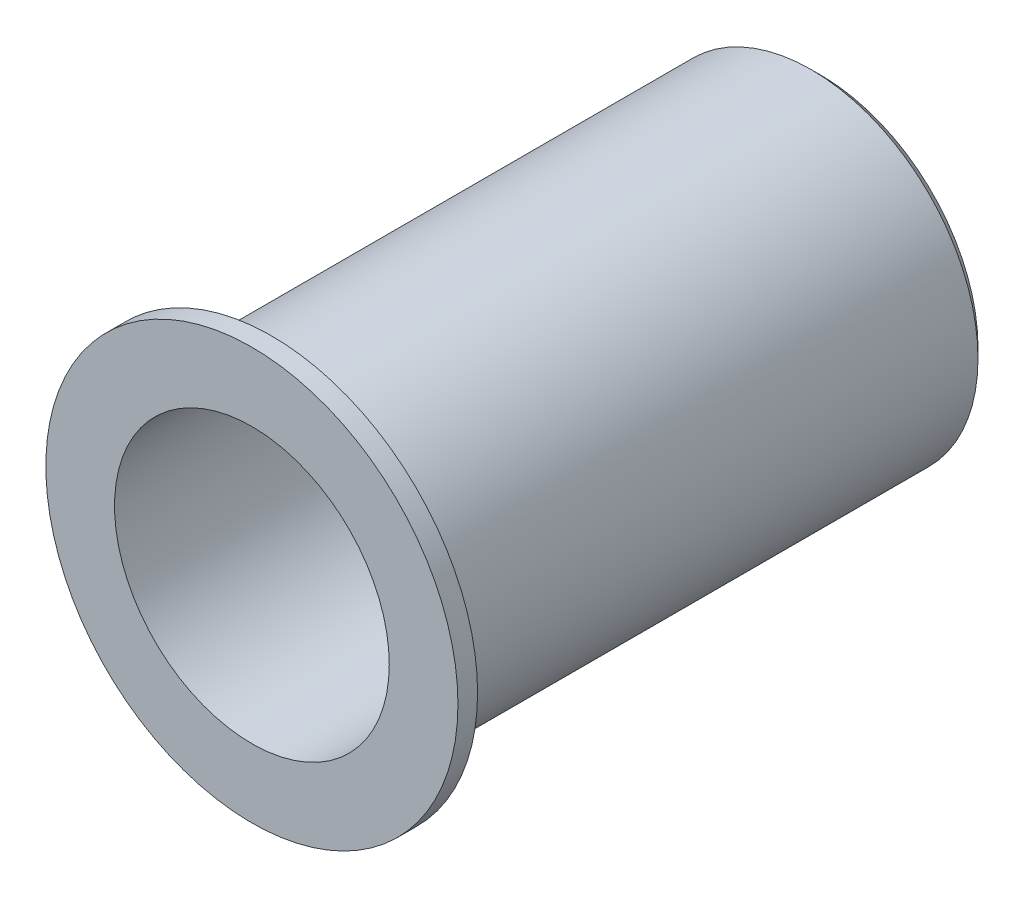
ISO-10303-21;
HEADER;
FILE_DESCRIPTION(('STEP AP214'),'2;1');
FILE_NAME('part.step','',(''),(''),'','','');
FILE_SCHEMA(('AUTOMOTIVE_DESIGN { 1 0 10303 214 1 1 1 1 }'));
ENDSEC;
DATA;
#1=APPLICATION_CONTEXT('core data for automotive mechanical design processes');
#2=APPLICATION_PROTOCOL_DEFINITION('international standard','automotive_design',2000,#1);
#3=PRODUCT_CONTEXT('',#1,'mechanical');
#4=PRODUCT('Part','Part','',(#3));
#5=PRODUCT_RELATED_PRODUCT_CATEGORY('part','',(#4));
#6=PRODUCT_DEFINITION_FORMATION('','',#4);
#7=PRODUCT_DEFINITION_CONTEXT('part definition',#1,'design');
#8=PRODUCT_DEFINITION('design','',#6,#7);
#9=PRODUCT_DEFINITION_SHAPE('','',#8);
#10=(LENGTH_UNIT() NAMED_UNIT(*) SI_UNIT(.MILLI.,.METRE.));
#11=(NAMED_UNIT(*) PLANE_ANGLE_UNIT() SI_UNIT($,.RADIAN.));
#12=(NAMED_UNIT(*) SI_UNIT($,.STERADIAN.) SOLID_ANGLE_UNIT());
#13=UNCERTAINTY_MEASURE_WITH_UNIT(LENGTH_MEASURE(1.E-05),#10,'distance_accuracy_value','');
#14=(GEOMETRIC_REPRESENTATION_CONTEXT(3) GLOBAL_UNCERTAINTY_ASSIGNED_CONTEXT((#13)) GLOBAL_UNIT_ASSIGNED_CONTEXT((#10,
#11,#12)) REPRESENTATION_CONTEXT('',''));
#15=CARTESIAN_POINT('',(0.,0.,0.));
#16=DIRECTION('',(0.,0.,1.));
#17=DIRECTION('',(1.,0.,0.));
#18=AXIS2_PLACEMENT_3D('',#15,#16,#17);
#19=CARTESIAN_POINT('',(0.,0.,28.));
#20=DIRECTION('',(0.,0.,-1.));
#21=DIRECTION('',(-1.,0.,0.));
#22=AXIS2_PLACEMENT_3D('',#19,#20,#21);
#23=CYLINDRICAL_SURFACE('',#22,8.5);
#24=CARTESIAN_POINT('',(0.,0.,0.500000000000007));
#25=DIRECTION('',(0.,0.,1.));
#26=DIRECTION('',(1.,0.,0.));
#27=AXIS2_PLACEMENT_3D('',#24,#25,#26);
#28=CIRCLE('',#27,8.5);
#29=CARTESIAN_POINT('',(8.5,0.,0.500000000000007));
#30=VERTEX_POINT('',#29);
#31=EDGE_CURVE('E51',#30,#30,#28,.T.);
#32=ORIENTED_EDGE('',*,*,#31,.T.);
#33=EDGE_LOOP('',(#32));
#34=FACE_BOUND('',#33,.T.);
#35=CARTESIAN_POINT('',(0.,0.,28.));
#36=DIRECTION('',(0.,0.,1.));
#37=DIRECTION('',(1.,0.,0.));
#38=AXIS2_PLACEMENT_3D('',#35,#36,#37);
#39=CIRCLE('',#38,8.5);
#40=CARTESIAN_POINT('',(8.5,0.,28.));
#41=VERTEX_POINT('',#40);
#42=EDGE_CURVE('E56',#41,#41,#39,.T.);
#43=ORIENTED_EDGE('',*,*,#42,.F.);
#44=EDGE_LOOP('',(#43));
#45=FACE_BOUND('',#44,.T.);
#46=ADVANCED_FACE('F42',(#34,#45),#23,.T.);
#47=CARTESIAN_POINT('',(0.,0.,0.));
#48=DIRECTION('',(0.,0.,1.));
#49=DIRECTION('',(1.,0.,0.));
#50=AXIS2_PLACEMENT_3D('',#47,#48,#49);
#51=PLANE('',#50);
#52=CARTESIAN_POINT('',(0.,0.,0.));
#53=DIRECTION('',(0.,0.,1.));
#54=DIRECTION('',(1.,0.,0.));
#55=AXIS2_PLACEMENT_3D('',#52,#53,#54);
#56=CIRCLE('',#55,7.99999999999999);
#57=CARTESIAN_POINT('',(7.99999999999999,0.,0.));
#58=VERTEX_POINT('',#57);
#59=EDGE_CURVE('E10',#58,#58,#56,.F.);
#60=ORIENTED_EDGE('',*,*,#59,.T.);
#61=EDGE_LOOP('',(#60));
#62=FACE_BOUND('',#61,.T.);
#63=CARTESIAN_POINT('',(0.,5.,0.));
#64=DIRECTION('',(0.,0.,-1.));
#65=DIRECTION('',(-1.,0.,0.));
#66=AXIS2_PLACEMENT_3D('',#63,#64,#65);
#67=CIRCLE('',#66,1.65);
#68=CARTESIAN_POINT('',(-1.65,5.,0.));
#69=VERTEX_POINT('',#68);
#70=EDGE_CURVE('E69',#69,#69,#67,.T.);
#71=ORIENTED_EDGE('',*,*,#70,.F.);
#72=EDGE_LOOP('',(#71));
#73=FACE_BOUND('',#72,.T.);
#74=CARTESIAN_POINT('',(0.,0.,0.));
#75=DIRECTION('',(0.,0.,-1.));
#76=DIRECTION('',(-1.,0.,0.));
#77=AXIS2_PLACEMENT_3D('',#74,#75,#76);
#78=CIRCLE('',#77,1.65);
#79=CARTESIAN_POINT('',(-1.65,0.,0.));
#80=VERTEX_POINT('',#79);
#81=EDGE_CURVE('E68',#80,#80,#78,.T.);
#82=ORIENTED_EDGE('',*,*,#81,.F.);
#83=EDGE_LOOP('',(#82));
#84=FACE_BOUND('',#83,.T.);
#85=CARTESIAN_POINT('',(4.33012701892166,-2.50000000000031,0.));
#86=DIRECTION('',(0.,0.,-1.));
#87=DIRECTION('',(-1.,0.,0.));
#88=AXIS2_PLACEMENT_3D('',#85,#86,#87);
#89=CIRCLE('',#88,1.65);
#90=CARTESIAN_POINT('',(2.68012701892166,-2.50000000000031,0.));
#91=VERTEX_POINT('',#90);
#92=EDGE_CURVE('E75',#91,#91,#89,.T.);
#93=ORIENTED_EDGE('',*,*,#92,.F.);
#94=EDGE_LOOP('',(#93));
#95=FACE_BOUND('',#94,.T.);
#96=CARTESIAN_POINT('',(-4.33012701892272,-2.49999999999969,0.));
#97=DIRECTION('',(0.,0.,-1.));
#98=DIRECTION('',(-1.,0.,0.));
#99=AXIS2_PLACEMENT_3D('',#96,#97,#98);
#100=CIRCLE('',#99,1.65);
#101=CARTESIAN_POINT('',(-5.98012701892272,-2.49999999999969,0.));
#102=VERTEX_POINT('',#101);
#103=EDGE_CURVE('E74',#102,#102,#100,.T.);
#104=ORIENTED_EDGE('',*,*,#103,.F.);
#105=EDGE_LOOP('',(#104));
#106=FACE_BOUND('',#105,.T.);
#107=ADVANCED_FACE('F133',(#62,#73,#84,#95,#106),#51,.F.);
#108=CARTESIAN_POINT('',(0.,0.,5.));
#109=DIRECTION('',(0.,0.,1.));
#110=DIRECTION('',(1.,0.,0.));
#111=AXIS2_PLACEMENT_3D('',#108,#109,#110);
#112=CYLINDRICAL_SURFACE('',#111,7.);
#113=CARTESIAN_POINT('',(0.,0.,5.));
#114=DIRECTION('',(0.,0.,1.));
#115=DIRECTION('',(1.,0.,0.));
#116=AXIS2_PLACEMENT_3D('',#113,#114,#115);
#117=CIRCLE('',#116,7.);
#118=CARTESIAN_POINT('',(7.,0.,5.));
#119=VERTEX_POINT('',#118);
#120=EDGE_CURVE('E61',#119,#119,#117,.T.);
#121=ORIENTED_EDGE('',*,*,#120,.F.);
#122=EDGE_LOOP('',(#121));
#123=FACE_BOUND('',#122,.T.);
#124=CARTESIAN_POINT('',(0.,0.,29.));
#125=DIRECTION('',(0.,0.,1.));
#126=DIRECTION('',(1.,0.,0.));
#127=AXIS2_PLACEMENT_3D('',#124,#125,#126);
#128=CIRCLE('',#127,7.);
#129=CARTESIAN_POINT('',(7.,0.,29.));
#130=VERTEX_POINT('',#129);
#131=EDGE_CURVE('E99',#130,#130,#128,.F.);
#132=ORIENTED_EDGE('',*,*,#131,.F.);
#133=EDGE_LOOP('',(#132));
#134=FACE_BOUND('',#133,.T.);
#135=ADVANCED_FACE('F137',(#123,#134),#112,.F.);
#136=CARTESIAN_POINT('',(0.,0.,5.));
#137=DIRECTION('',(0.,0.,1.));
#138=DIRECTION('',(1.,0.,0.));
#139=AXIS2_PLACEMENT_3D('',#136,#137,#138);
#140=PLANE('',#139);
#141=CARTESIAN_POINT('',(0.,5.,5.));
#142=DIRECTION('',(0.,0.,1.));
#143=DIRECTION('',(1.,0.,0.));
#144=AXIS2_PLACEMENT_3D('',#141,#142,#143);
#145=CIRCLE('',#144,1.65);
#146=CARTESIAN_POINT('',(1.65,5.,5.));
#147=VERTEX_POINT('',#146);
#148=EDGE_CURVE('E64',#147,#147,#145,.T.);
#149=ORIENTED_EDGE('',*,*,#148,.F.);
#150=EDGE_LOOP('',(#149));
#151=FACE_BOUND('',#150,.T.);
#152=CARTESIAN_POINT('',(0.,0.,5.));
#153=DIRECTION('',(0.,0.,1.));
#154=DIRECTION('',(1.,0.,0.));
#155=AXIS2_PLACEMENT_3D('',#152,#153,#154);
#156=CIRCLE('',#155,1.65);
#157=CARTESIAN_POINT('',(1.65,0.,5.));
#158=VERTEX_POINT('',#157);
#159=EDGE_CURVE('E89',#158,#158,#156,.T.);
#160=ORIENTED_EDGE('',*,*,#159,.F.);
#161=EDGE_LOOP('',(#160));
#162=FACE_BOUND('',#161,.T.);
#163=CARTESIAN_POINT('',(4.33012701892166,-2.50000000000031,5.));
#164=DIRECTION('',(0.,0.,1.));
#165=DIRECTION('',(1.,0.,0.));
#166=AXIS2_PLACEMENT_3D('',#163,#164,#165);
#167=CIRCLE('',#166,1.65);
#168=CARTESIAN_POINT('',(5.98012701892166,-2.50000000000031,5.));
#169=VERTEX_POINT('',#168);
#170=EDGE_CURVE('E70',#169,#169,#167,.T.);
#171=ORIENTED_EDGE('',*,*,#170,.F.);
#172=EDGE_LOOP('',(#171));
#173=FACE_BOUND('',#172,.T.);
#174=CARTESIAN_POINT('',(-4.33012701892272,-2.49999999999969,5.));
#175=DIRECTION('',(0.,0.,1.));
#176=DIRECTION('',(1.,0.,0.));
#177=AXIS2_PLACEMENT_3D('',#174,#175,#176);
#178=CIRCLE('',#177,1.65);
#179=CARTESIAN_POINT('',(-2.68012701892273,-2.49999999999969,5.));
#180=VERTEX_POINT('',#179);
#181=EDGE_CURVE('E76',#180,#180,#178,.T.);
#182=ORIENTED_EDGE('',*,*,#181,.F.);
#183=EDGE_LOOP('',(#182));
#184=FACE_BOUND('',#183,.T.);
#185=ORIENTED_EDGE('',*,*,#120,.T.);
#186=EDGE_LOOP('',(#185));
#187=FACE_BOUND('',#186,.T.);
#188=ADVANCED_FACE('F143',(#151,#162,#173,#184,#187),#140,.T.);
#189=CARTESIAN_POINT('',(-4.33012701892272,-2.49999999999969,0.));
#190=DIRECTION('',(0.,0.,-1.));
#191=DIRECTION('',(-1.,0.,0.));
#192=AXIS2_PLACEMENT_3D('',#189,#190,#191);
#193=CYLINDRICAL_SURFACE('',#192,1.65);
#194=ORIENTED_EDGE('',*,*,#181,.T.);
#195=EDGE_LOOP('',(#194));
#196=FACE_BOUND('',#195,.T.);
#197=ORIENTED_EDGE('',*,*,#103,.T.);
#198=EDGE_LOOP('',(#197));
#199=FACE_BOUND('',#198,.T.);
#200=ADVANCED_FACE('F147',(#196,#199),#193,.F.);
#201=CARTESIAN_POINT('',(4.33012701892166,-2.50000000000031,0.));
#202=DIRECTION('',(0.,0.,-1.));
#203=DIRECTION('',(-1.,0.,0.));
#204=AXIS2_PLACEMENT_3D('',#201,#202,#203);
#205=CYLINDRICAL_SURFACE('',#204,1.65);
#206=ORIENTED_EDGE('',*,*,#170,.T.);
#207=EDGE_LOOP('',(#206));
#208=FACE_BOUND('',#207,.T.);
#209=ORIENTED_EDGE('',*,*,#92,.T.);
#210=EDGE_LOOP('',(#209));
#211=FACE_BOUND('',#210,.T.);
#212=ADVANCED_FACE('F151',(#208,#211),#205,.F.);
#213=CARTESIAN_POINT('',(0.,0.,0.));
#214=DIRECTION('',(0.,0.,-1.));
#215=DIRECTION('',(-1.,0.,0.));
#216=AXIS2_PLACEMENT_3D('',#213,#214,#215);
#217=CYLINDRICAL_SURFACE('',#216,1.65);
#218=ORIENTED_EDGE('',*,*,#159,.T.);
#219=EDGE_LOOP('',(#218));
#220=FACE_BOUND('',#219,.T.);
#221=ORIENTED_EDGE('',*,*,#81,.T.);
#222=EDGE_LOOP('',(#221));
#223=FACE_BOUND('',#222,.T.);
#224=ADVANCED_FACE('F155',(#220,#223),#217,.F.);
#225=CARTESIAN_POINT('',(0.,5.,0.));
#226=DIRECTION('',(0.,0.,-1.));
#227=DIRECTION('',(-1.,0.,0.));
#228=AXIS2_PLACEMENT_3D('',#225,#226,#227);
#229=CYLINDRICAL_SURFACE('',#228,1.65);
#230=ORIENTED_EDGE('',*,*,#148,.T.);
#231=EDGE_LOOP('',(#230));
#232=FACE_BOUND('',#231,.T.);
#233=ORIENTED_EDGE('',*,*,#70,.T.);
#234=EDGE_LOOP('',(#233));
#235=FACE_BOUND('',#234,.T.);
#236=ADVANCED_FACE('F118',(#232,#235),#229,.F.);
#237=CARTESIAN_POINT('',(0.,0.,29.));
#238=DIRECTION('',(0.,0.,-1.));
#239=DIRECTION('',(-1.,0.,0.));
#240=AXIS2_PLACEMENT_3D('',#237,#238,#239);
#241=CYLINDRICAL_SURFACE('',#240,10.5);
#242=CARTESIAN_POINT('',(0.,0.,29.));
#243=DIRECTION('',(0.,0.,1.));
#244=DIRECTION('',(1.,0.,0.));
#245=AXIS2_PLACEMENT_3D('',#242,#243,#244);
#246=CIRCLE('',#245,10.5);
#247=CARTESIAN_POINT('',(10.5,0.,29.));
#248=VERTEX_POINT('',#247);
#249=EDGE_CURVE('E104',#248,#248,#246,.T.);
#250=ORIENTED_EDGE('',*,*,#249,.F.);
#251=EDGE_LOOP('',(#250));
#252=FACE_BOUND('',#251,.T.);
#253=CARTESIAN_POINT('',(0.,0.,28.));
#254=DIRECTION('',(0.,0.,1.));
#255=DIRECTION('',(1.,0.,0.));
#256=AXIS2_PLACEMENT_3D('',#253,#254,#255);
#257=CIRCLE('',#256,10.5);
#258=CARTESIAN_POINT('',(10.5,0.,28.));
#259=VERTEX_POINT('',#258);
#260=EDGE_CURVE('E100',#259,#259,#257,.T.);
#261=ORIENTED_EDGE('',*,*,#260,.T.);
#262=EDGE_LOOP('',(#261));
#263=FACE_BOUND('',#262,.T.);
#264=ADVANCED_FACE('F115',(#252,#263),#241,.T.);
#265=CARTESIAN_POINT('',(0.,0.,29.));
#266=DIRECTION('',(0.,0.,1.));
#267=DIRECTION('',(1.,0.,0.));
#268=AXIS2_PLACEMENT_3D('',#265,#266,#267);
#269=PLANE('',#268);
#270=ORIENTED_EDGE('',*,*,#249,.T.);
#271=EDGE_LOOP('',(#270));
#272=FACE_BOUND('',#271,.T.);
#273=ORIENTED_EDGE('',*,*,#131,.T.);
#274=EDGE_LOOP('',(#273));
#275=FACE_BOUND('',#274,.T.);
#276=ADVANCED_FACE('F112',(#272,#275),#269,.T.);
#277=CARTESIAN_POINT('',(0.,0.,28.));
#278=DIRECTION('',(0.,0.,1.));
#279=DIRECTION('',(1.,0.,0.));
#280=AXIS2_PLACEMENT_3D('',#277,#278,#279);
#281=PLANE('',#280);
#282=ORIENTED_EDGE('',*,*,#42,.T.);
#283=EDGE_LOOP('',(#282));
#284=FACE_BOUND('',#283,.T.);
#285=ORIENTED_EDGE('',*,*,#260,.F.);
#286=EDGE_LOOP('',(#285));
#287=FACE_BOUND('',#286,.T.);
#288=ADVANCED_FACE('F122',(#284,#287),#281,.F.);
#289=CARTESIAN_POINT('',(0.,0.,0.500000000000007));
#290=DIRECTION('',(0.,0.,1.));
#291=DIRECTION('',(1.,0.,0.));
#292=AXIS2_PLACEMENT_3D('',#289,#290,#291);
#293=CONICAL_SURFACE('',#292,8.5,0.78539816339745);
#294=ORIENTED_EDGE('',*,*,#59,.F.);
#295=EDGE_LOOP('',(#294));
#296=FACE_BOUND('',#295,.T.);
#297=ORIENTED_EDGE('',*,*,#31,.F.);
#298=EDGE_LOOP('',(#297));
#299=FACE_BOUND('',#298,.T.);
#300=ADVANCED_FACE('F45',(#296,#299),#293,.T.);
#301=CLOSED_SHELL('',(#46,#107,#135,#188,#200,#212,#224,#236,#264,#276,#288,#300));
#302=MANIFOLD_SOLID_BREP('B2',#301);
#303=ADVANCED_BREP_SHAPE_REPRESENTATION('',(#18,#302),#14);
#304=SHAPE_DEFINITION_REPRESENTATION(#9,#303);
ENDSEC;
END-ISO-10303-21;
